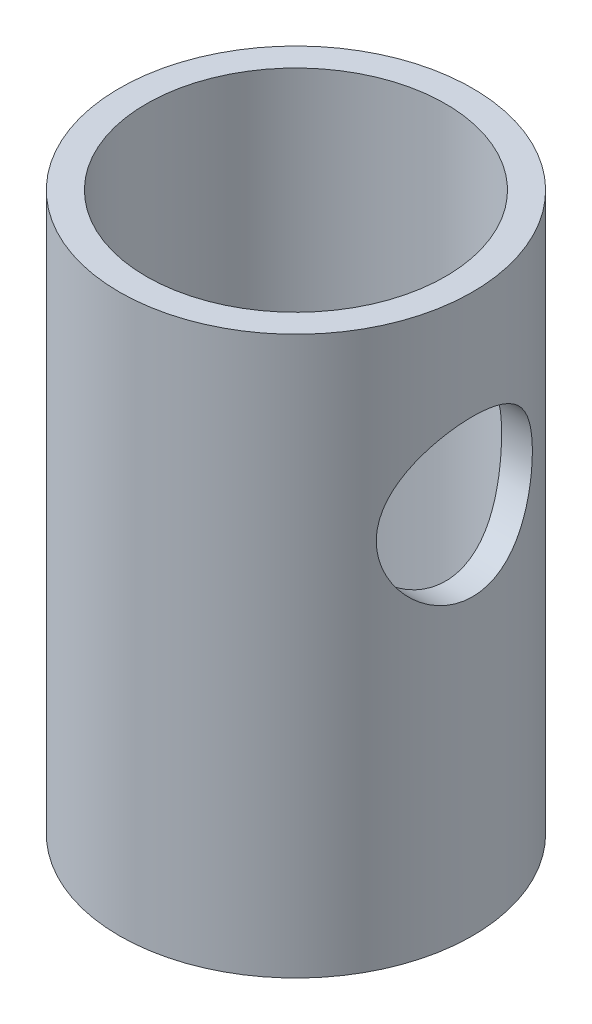
ISO-10303-21;
HEADER;
FILE_DESCRIPTION(('STEP AP214'),'2;1');
FILE_NAME('part.step','',(''),(''),'','','');
FILE_SCHEMA(('AUTOMOTIVE_DESIGN { 1 0 10303 214 1 1 1 1 }'));
ENDSEC;
DATA;
#1=APPLICATION_CONTEXT('core data for automotive mechanical design processes');
#2=APPLICATION_PROTOCOL_DEFINITION('international standard','automotive_design',2000,#1);
#3=PRODUCT_CONTEXT('',#1,'mechanical');
#4=PRODUCT('Part','Part','',(#3));
#5=PRODUCT_RELATED_PRODUCT_CATEGORY('part','',(#4));
#6=PRODUCT_DEFINITION_FORMATION('','',#4);
#7=PRODUCT_DEFINITION_CONTEXT('part definition',#1,'design');
#8=PRODUCT_DEFINITION('design','',#6,#7);
#9=PRODUCT_DEFINITION_SHAPE('','',#8);
#10=(LENGTH_UNIT() NAMED_UNIT(*) SI_UNIT(.MILLI.,.METRE.));
#11=(NAMED_UNIT(*) PLANE_ANGLE_UNIT() SI_UNIT($,.RADIAN.));
#12=(NAMED_UNIT(*) SI_UNIT($,.STERADIAN.) SOLID_ANGLE_UNIT());
#13=UNCERTAINTY_MEASURE_WITH_UNIT(LENGTH_MEASURE(1.E-05),#10,'distance_accuracy_value','');
#14=(GEOMETRIC_REPRESENTATION_CONTEXT(3) GLOBAL_UNCERTAINTY_ASSIGNED_CONTEXT((#13)) GLOBAL_UNIT_ASSIGNED_CONTEXT((#10,
#11,#12)) REPRESENTATION_CONTEXT('',''));
#15=CARTESIAN_POINT('',(0.,0.,0.));
#16=DIRECTION('',(0.,0.,1.));
#17=DIRECTION('',(1.,0.,0.));
#18=AXIS2_PLACEMENT_3D('',#15,#16,#17);
#19=CARTESIAN_POINT('',(0.,76.2,0.));
#20=DIRECTION('',(0.,-1.,0.));
#21=DIRECTION('',(0.,0.,-1.));
#22=AXIS2_PLACEMENT_3D('',#19,#20,#21);
#23=CYLINDRICAL_SURFACE('',#22,24.13);
#24=CARTESIAN_POINT('',(0.,76.2,0.));
#25=DIRECTION('',(0.,1.,0.));
#26=DIRECTION('',(0.,0.,1.));
#27=AXIS2_PLACEMENT_3D('',#24,#25,#26);
#28=CIRCLE('',#27,24.13);
#29=CARTESIAN_POINT('',(0.,76.2,24.13));
#30=VERTEX_POINT('',#29);
#31=EDGE_CURVE('E10',#30,#30,#28,.T.);
#32=ORIENTED_EDGE('',*,*,#31,.F.);
#33=EDGE_LOOP('',(#32));
#34=FACE_BOUND('',#33,.T.);
#35=CARTESIAN_POINT('',(0.,0.,0.));
#36=DIRECTION('',(0.,1.,0.));
#37=DIRECTION('',(0.,0.,1.));
#38=AXIS2_PLACEMENT_3D('',#35,#36,#37);
#39=CIRCLE('',#38,24.13);
#40=CARTESIAN_POINT('',(0.,0.,24.13));
#41=VERTEX_POINT('',#40);
#42=EDGE_CURVE('E46',#41,#41,#39,.T.);
#43=ORIENTED_EDGE('',*,*,#42,.T.);
#44=EDGE_LOOP('',(#43));
#45=FACE_BOUND('',#44,.T.);
#46=CARTESIAN_POINT('',(21.643721399057,50.8,10.668));
#47=CARTESIAN_POINT('',(21.6437238929743,50.5172348359315,10.6679977628718));
#48=CARTESIAN_POINT('',(21.6492818983185,50.2343903368031,10.6567415273903));
#49=CARTESIAN_POINT('',(21.6713265091591,49.6707914267036,10.6118382845818));
#50=CARTESIAN_POINT('',(21.6878196727223,49.3900383722562,10.5781778408867));
#51=CARTESIAN_POINT('',(21.7312031013358,48.8322649284761,10.4887645413648));
#52=CARTESIAN_POINT('',(21.7581156524137,48.5552538662205,10.4329643243829));
#53=CARTESIAN_POINT('',(21.8214229271272,48.0075367107023,10.2998940707166));
#54=CARTESIAN_POINT('',(21.8578185129239,47.7368311931547,10.2226220818587));
#55=CARTESIAN_POINT('',(21.9387312594079,47.204710334102,10.0477954852205));
#56=CARTESIAN_POINT('',(21.9832107081135,46.9432583222672,9.95033477632834));
#57=CARTESIAN_POINT('',(22.0790677447889,46.429854145989,9.73578260472499));
#58=CARTESIAN_POINT('',(22.1304455519079,46.1779022836751,9.61869051832881));
#59=CARTESIAN_POINT('',(22.2386362533096,45.6849155655768,9.36583422612657));
#60=CARTESIAN_POINT('',(22.2954469179531,45.4438762906109,9.23007767027364));
#61=CARTESIAN_POINT('',(22.4130509750466,44.9736785447172,8.94071802371263));
#62=CARTESIAN_POINT('',(22.4738457181274,44.7445241505045,8.78710886705377));
#63=CARTESIAN_POINT('',(22.6018492117889,44.2850440626589,8.45265468550407));
#64=CARTESIAN_POINT('',(22.6692199437986,44.055571581713,8.27069858595581));
#65=CARTESIAN_POINT('',(22.8049606871159,43.612508232859,7.88871031250229));
#66=CARTESIAN_POINT('',(22.8733307469606,43.3989181394434,7.68867725814051));
#67=CARTESIAN_POINT('',(23.0093552489534,42.9886471372641,7.27149405813427));
#68=CARTESIAN_POINT('',(23.0770092584969,42.7919759899197,7.05433416778064));
#69=CARTESIAN_POINT('',(23.2098350907993,42.4168905588581,6.60420309627603));
#70=CARTESIAN_POINT('',(23.2750077595255,42.2384700173019,6.37123738056867));
#71=CARTESIAN_POINT('',(23.40443490185,41.8924794701364,5.87855390769274));
#72=CARTESIAN_POINT('',(23.4684787991014,41.7259047335671,5.61808017074851));
#73=CARTESIAN_POINT('',(23.5902590762703,41.4154358778598,5.08251745632002));
#74=CARTESIAN_POINT('',(23.647995186105,41.271542729771,4.80742785377183));
#75=CARTESIAN_POINT('',(23.7554770064737,41.0078343025141,4.2445566901455));
#76=CARTESIAN_POINT('',(23.8052257946373,40.8880097448832,3.95678007229774));
#77=CARTESIAN_POINT('',(23.8952786432969,40.6736415299517,3.370530237231));
#78=CARTESIAN_POINT('',(23.9355834594923,40.5790958497695,3.07205787808203));
#79=CARTESIAN_POINT('',(24.0034953862544,40.4210838774224,2.48425626600895));
#80=CARTESIAN_POINT('',(24.03170101523,40.3561389562093,2.1953933053702));
#81=CARTESIAN_POINT('',(24.077838653201,40.2504072281897,1.61246605301352));
#82=CARTESIAN_POINT('',(24.0957710242367,40.2096195700546,1.31840194496597));
#83=CARTESIAN_POINT('',(24.1208408999613,40.152702557313,0.727553722890027));
#84=CARTESIAN_POINT('',(24.1279826171395,40.1365635802506,0.430770715818948));
#85=CARTESIAN_POINT('',(24.1312754119007,40.1291147405135,-0.163161882153493));
#86=CARTESIAN_POINT('',(24.1274269812917,40.1378037667882,-0.460311456056217));
#87=CARTESIAN_POINT('',(24.109492214626,40.1784542396317,-1.03221429151895));
#88=CARTESIAN_POINT('',(24.0961247938533,40.2087817520009,-1.30710814677459));
#89=CARTESIAN_POINT('',(24.0602929178545,40.2905580018281,-1.85311861349321));
#90=CARTESIAN_POINT('',(24.0378289602593,40.3420055839034,-2.12423543074198));
#91=CARTESIAN_POINT('',(23.9843568140684,40.4655048460105,-2.66087412748726));
#92=CARTESIAN_POINT('',(23.9533483378119,40.5375572197285,-2.92639581829363));
#93=CARTESIAN_POINT('',(23.8835326656958,40.7015862132358,-3.45015621685971));
#94=CARTESIAN_POINT('',(23.8447252223362,40.7935634653479,-3.70839469319013));
#95=CARTESIAN_POINT('',(23.7595826777815,40.998169863646,-4.21987652114506));
#96=CARTESIAN_POINT('',(23.7131432584816,41.1110884727117,-4.47298657194023));
#97=CARTESIAN_POINT('',(23.6142288564178,41.3557610470353,-4.96880609230699));
#98=CARTESIAN_POINT('',(23.5617517176067,41.4875217448382,-5.21151180379685));
#99=CARTESIAN_POINT('',(23.4519601662138,41.7689125962634,-5.68520765309818));
#100=CARTESIAN_POINT('',(23.394645289597,41.918544464658,-5.9161966636358));
#101=CARTESIAN_POINT('',(23.2764532178139,42.2347156712111,-6.36534086693001));
#102=CARTESIAN_POINT('',(23.2155757955955,42.4012560875019,-6.58349523991468));
#103=CARTESIAN_POINT('',(23.0867614042279,42.763906285462,-7.02243962903749));
#104=CARTESIAN_POINT('',(23.0186440303352,42.9613090412298,-7.2421097577275));
#105=CARTESIAN_POINT('',(22.8815637407171,43.3734897015066,-7.66421529494829));
#106=CARTESIAN_POINT('',(22.8126007883285,43.5882683616892,-7.86664995312633));
#107=CARTESIAN_POINT('',(22.6755978934853,44.0341239990691,-8.25325639570743));
#108=CARTESIAN_POINT('',(22.6075583469827,44.2652077199454,-8.4374205468674));
#109=CARTESIAN_POINT('',(22.4742627495828,44.7424180249921,-8.78631327080946));
#110=CARTESIAN_POINT('',(22.4090070581414,44.9885465418494,-8.95103933853463));
#111=CARTESIAN_POINT('',(22.2805517258455,45.5049661467721,-9.26628713230868));
#112=CARTESIAN_POINT('',(22.2175474445416,45.7758348830292,-9.41594446544033));
#113=CARTESIAN_POINT('',(22.0986844573346,46.3307091602367,-9.69162445431708));
#114=CARTESIAN_POINT('',(22.0428226028332,46.6147088369664,-9.81765753584738));
#115=CARTESIAN_POINT('',(21.9402158215194,47.1939520563278,-10.0448682589772));
#116=CARTESIAN_POINT('',(21.8934669822608,47.4891907084237,-10.1460565719238));
#117=CARTESIAN_POINT('',(21.8108485569363,48.0888085653558,-10.322465681998));
#118=CARTESIAN_POINT('',(21.7749778519041,48.3931868265148,-10.3976891500785));
#119=CARTESIAN_POINT('',(21.7176620213903,48.9869222197478,-10.5168488732797));
#120=CARTESIAN_POINT('',(21.6953805871389,49.2758326496267,-10.5626116812702));
#121=CARTESIAN_POINT('',(21.6623082351395,49.857088915808,-10.6302743892794));
#122=CARTESIAN_POINT('',(21.6515167681972,50.1494345872383,-10.6521754298376));
#123=CARTESIAN_POINT('',(21.6418395551652,50.7350252321199,-10.6718227472924));
#124=CARTESIAN_POINT('',(21.6429494387755,51.0282698359312,-10.6695778908134));
#125=CARTESIAN_POINT('',(21.6570222045817,51.6132868305406,-10.6409841785262));
#126=CARTESIAN_POINT('',(21.6699846302435,51.9050592776078,-10.6146362511157));
#127=CARTESIAN_POINT('',(21.7058382102837,52.4625720253878,-10.5411101968457));
#128=CARTESIAN_POINT('',(21.7278955848098,52.7285987970343,-10.4956763786638));
#129=CARTESIAN_POINT('',(21.7810067017056,53.2556769888029,-10.3850089989981));
#130=CARTESIAN_POINT('',(21.812063511071,53.5167266803633,-10.3197686871251));
#131=CARTESIAN_POINT('',(21.8822296458035,54.0321009750747,-10.1701396954301));
#132=CARTESIAN_POINT('',(21.9213374557648,54.2864268336734,-10.0857546188416));
#133=CARTESIAN_POINT('',(22.0065140774209,54.7870888273935,-9.89852569545463));
#134=CARTESIAN_POINT('',(22.0525856211738,55.0334217804081,-9.79567460095827));
#135=CARTESIAN_POINT('',(22.1526119948554,55.5274320873537,-9.56738641993507));
#136=CARTESIAN_POINT('',(22.2068250179896,55.7746889072217,-9.44115281916885));
#137=CARTESIAN_POINT('',(22.3200386627482,56.2578987519137,-9.17029555961702));
#138=CARTESIAN_POINT('',(22.3790413720952,56.4938467754338,-9.02566386574975));
#139=CARTESIAN_POINT('',(22.5003179959366,56.9532707339861,-8.71893257148724));
#140=CARTESIAN_POINT('',(22.5625924893431,57.1767444472782,-8.5568298743874));
#141=CARTESIAN_POINT('',(22.6888982668138,57.6101699625889,-8.21607042185577));
#142=CARTESIAN_POINT('',(22.7529296416136,57.8201210643382,-8.03741281029327));
#143=CARTESIAN_POINT('',(22.8873063988564,58.2446212560757,-7.64687219228914));
#144=CARTESIAN_POINT('',(22.9576789081601,58.4577437229755,-7.43344465787121));
#145=CARTESIAN_POINT('',(23.0968267854509,58.8653218394593,-6.98911077890607));
#146=CARTESIAN_POINT('',(23.1656026682547,59.059783571214,-6.75821017361705));
#147=CARTESIAN_POINT('',(23.2997922487106,59.4289766193138,-6.27999044034848));
#148=CARTESIAN_POINT('',(23.3652040234202,59.6036967180509,-6.03266210325822));
#149=CARTESIAN_POINT('',(23.490845721928,59.9319296645752,-5.52321096131169));
#150=CARTESIAN_POINT('',(23.5510778854282,60.0854516961331,-5.26109463291717));
#151=CARTESIAN_POINT('',(23.6652230157958,60.3712810025225,-4.72131660527399));
#152=CARTESIAN_POINT('',(23.7190794866081,60.5034019520966,-4.44354409374242));
#153=CARTESIAN_POINT('',(23.8183536632448,60.7436040914915,-3.87631465043014));
#154=CARTESIAN_POINT('',(23.8637712276046,60.851684878324,-3.58685752287473));
#155=CARTESIAN_POINT('',(23.9448040185114,61.0425794113759,-2.99856068518844));
#156=CARTESIAN_POINT('',(23.9804246934347,61.125407204419,-2.6997262935124));
#157=CARTESIAN_POINT('',(24.040808020632,61.2648810902704,-2.09493830661424));
#158=CARTESIAN_POINT('',(24.0655716184912,61.3215294631699,-1.78898533382223));
#159=CARTESIAN_POINT('',(24.1020110106598,61.4045994631909,-1.19633603222497));
#160=CARTESIAN_POINT('',(24.1145474674705,61.4330120439282,-0.909970111230644));
#161=CARTESIAN_POINT('',(24.1293755240433,61.466598318952,-0.335619865803533));
#162=CARTESIAN_POINT('',(24.1316676773395,61.471773268846,-0.0476356296556866));
#163=CARTESIAN_POINT('',(24.1259450833395,61.4588264732959,0.527646714649943));
#164=CARTESIAN_POINT('',(24.1179323122445,61.4407091946608,0.814944943780637));
#165=CARTESIAN_POINT('',(24.0918223206824,61.3813957378607,1.38668132630315));
#166=CARTESIAN_POINT('',(24.0737252121204,61.3401998157977,1.671119511397));
#167=CARTESIAN_POINT('',(24.0289374519508,61.2374896787456,2.22266979694318));
#168=CARTESIAN_POINT('',(24.0026566167092,61.1769413832718,2.4899960666298));
#169=CARTESIAN_POINT('',(23.9419570738193,61.0357556244966,3.01832655155642));
#170=CARTESIAN_POINT('',(23.9075386800225,60.9551189359634,3.27933101018985));
#171=CARTESIAN_POINT('',(23.831373717959,60.7744874419836,3.79342256073799));
#172=CARTESIAN_POINT('',(23.7896275761511,60.6744937630361,4.04651011238977));
#173=CARTESIAN_POINT('',(23.6997401496883,60.4559272001142,4.54345804926473));
#174=CARTESIAN_POINT('',(23.6515964157546,60.3373471973429,4.78731485438134));
#175=CARTESIAN_POINT('',(23.5476796804065,60.0767163783098,5.27529210352695));
#176=CARTESIAN_POINT('',(23.4916594057947,59.9338438674953,5.51892097190329));
#177=CARTESIAN_POINT('',(23.3751038917328,59.629752598283,5.99342448990041));
#178=CARTESIAN_POINT('',(23.3145669765783,59.468527018991,6.22429434998867));
#179=CARTESIAN_POINT('',(23.190386818345,59.1287675725899,6.6720955545669));
#180=CARTESIAN_POINT('',(23.1267430492722,58.9502307695884,6.88902452434588));
#181=CARTESIAN_POINT('',(22.9978230430922,58.5768811219934,7.30787664435476));
#182=CARTESIAN_POINT('',(22.932546731431,58.3820675331264,7.50979910759739));
#183=CARTESIAN_POINT('',(22.7967657755213,57.9613222464227,7.91284118258964));
#184=CARTESIAN_POINT('',(22.7262514613705,57.734148443613,8.11266317196043));
#185=CARTESIAN_POINT('',(22.5870730933772,57.263413954796,8.49246307849999));
#186=CARTESIAN_POINT('',(22.5184082805479,57.0198601387523,8.67244923249333));
#187=CARTESIAN_POINT('',(22.3848091441706,56.5173183859499,9.01168673646729));
#188=CARTESIAN_POINT('',(22.3198790659963,56.2583135409739,9.17091474058913));
#189=CARTESIAN_POINT('',(22.1958603036931,55.7266923644809,9.46712561695979));
#190=CARTESIAN_POINT('',(22.1367689507006,55.4540823384208,9.60411867131127));
#191=CARTESIAN_POINT('',(22.0261479134486,54.8958046731552,9.85518178883373));
#192=CARTESIAN_POINT('',(21.9746457355779,54.6100942296243,9.96916899514259));
#193=CARTESIAN_POINT('',(21.8813220681409,54.0285994012042,10.1723723563936));
#194=CARTESIAN_POINT('',(21.8394957370307,53.7328201398572,10.2616009044066));
#195=CARTESIAN_POINT('',(21.7671945151332,53.1341269236287,10.4140892954278));
#196=CARTESIAN_POINT('',(21.7366898343775,52.8312339546534,10.4774173343414));
#197=CARTESIAN_POINT('',(21.6881369467749,52.2202696467836,10.5775587767506));
#198=CARTESIAN_POINT('',(21.6700793535286,51.9122023898289,10.6143921608877));
#199=CARTESIAN_POINT('',(21.6536596198227,51.4694554397596,10.6478173860323));
#200=CARTESIAN_POINT('',(21.6499364193023,51.335712510108,10.6553828075778));
#201=CARTESIAN_POINT('',(21.6449666863159,51.06798566335,10.6654747090868));
#202=CARTESIAN_POINT('',(21.6437202171956,50.9340017401677,10.6680010601698));
#203=CARTESIAN_POINT('',(21.643721399057,50.8,10.668));
#204=B_SPLINE_CURVE_WITH_KNOTS('',3,(#46,#47,#48,#49,#50,#51,#52,#53,#54,#55,#56,#57,#58,#59,
#60,#61,#62,#63,#64,#65,#66,#67,#68,#69,#70,#71,#72,#73,#74,#75,#76,#77,#78,#79,#80,#81,#82,#83,
#84,#85,#86,#87,#88,#89,#90,#91,#92,#93,#94,#95,#96,#97,#98,#99,#100,#101,#102,#103,#104,#105,
#106,#107,#108,#109,#110,#111,#112,#113,#114,#115,#116,#117,#118,#119,#120,#121,#122,#123,#124,
#125,#126,#127,#128,#129,#130,#131,#132,#133,#134,#135,#136,#137,#138,#139,#140,#141,#142,#143,
#144,#145,#146,#147,#148,#149,#150,#151,#152,#153,#154,#155,#156,#157,#158,#159,#160,#161,#162,
#163,#164,#165,#166,#167,#168,#169,#170,#171,#172,#173,#174,#175,#176,#177,#178,#179,#180,#181,
#182,#183,#184,#185,#186,#187,#188,#189,#190,#191,#192,#193,#194,#195,#196,#197,#198,#199,#200,
#201,#202,#203),.UNSPECIFIED.,.T.,.F.,(4,2,2,2,2,2,2,2,2,2,2,2,2,2,2,2,2,2,2,2,2,2,2,2,2,2,2,2,
2,2,2,2,2,2,2,2,2,2,2,2,2,2,2,2,2,2,2,2,2,2,2,2,2,2,2,2,2,2,2,2,2,2,2,2,2,2,2,2,2,2,2,2,2,2,2,2,
2,2,4),(0.,0.848156658090868,1.69682243597562,2.5473135437935,3.39788200198872,4.24457983671681,
5.09130457596576,5.93768329944576,6.78435045063604,7.68488944313817,8.58547232097575,
9.48657135505696,10.3873603737098,11.3333985965687,12.279477310432,13.225190607181,
14.1708282028241,15.0618969602075,15.9529343134713,16.8436237308262,17.7342732905453,
18.5639496795708,19.393580686835,20.2232396279569,21.0529249024449,21.8950730485785,
22.7375228615442,23.5800535741876,24.4226380425257,25.3308962143502,26.2391939073403,
27.1478694943079,28.0566620580252,29.0028825253262,29.9486844211477,30.8940793618285,
31.8393770225766,32.7182739705781,33.5971289074145,34.4756611306072,35.3541595160817,
36.1655728012166,36.9772629408152,37.7888004388753,38.600657155081,39.4483466668265,
40.2964076730997,41.1446192446762,41.992874705678,42.9209562692759,43.8487343046004,
44.7770368994029,45.7049360494825,46.6405237445364,47.5761271217908,48.5112091218877,
49.4462096658576,50.3092428905189,51.1722294820252,52.0350506011139,52.8978621457336,
53.7229926826724,54.5480914009426,55.3731421162098,56.1985096120153,57.0613833685119,
57.9245788643967,58.7879210106019,59.6513026556869,60.5822016803633,61.5127126813104,
62.4442613248088,63.3753821710865,64.3097989018898,65.2437470584512,66.1752200529533,
67.1059898491453,67.5079189967809,67.9098584241265),.UNSPECIFIED.);
#205=CARTESIAN_POINT('',(21.643721399057,50.8,10.668));
#206=VERTEX_POINT('',#205);
#207=EDGE_CURVE('E56',#206,#206,#204,.T.);
#208=ORIENTED_EDGE('',*,*,#207,.F.);
#209=EDGE_LOOP('',(#208));
#210=FACE_BOUND('',#209,.T.);
#211=ADVANCED_FACE('F33',(#34,#45,#210),#23,.T.);
#212=CARTESIAN_POINT('',(0.,76.2,0.));
#213=DIRECTION('',(0.,-1.,0.));
#214=DIRECTION('',(0.,0.,-1.));
#215=AXIS2_PLACEMENT_3D('',#212,#213,#214);
#216=CYLINDRICAL_SURFACE('',#215,20.447);
#217=CARTESIAN_POINT('',(0.,0.,0.));
#218=DIRECTION('',(0.,1.,0.));
#219=DIRECTION('',(0.,0.,1.));
#220=AXIS2_PLACEMENT_3D('',#217,#218,#219);
#221=CIRCLE('',#220,20.447);
#222=CARTESIAN_POINT('',(0.,0.,20.447));
#223=VERTEX_POINT('',#222);
#224=EDGE_CURVE('E53',#223,#223,#221,.T.);
#225=ORIENTED_EDGE('',*,*,#224,.F.);
#226=EDGE_LOOP('',(#225));
#227=FACE_BOUND('',#226,.T.);
#228=CARTESIAN_POINT('',(0.,76.2,0.));
#229=DIRECTION('',(0.,1.,0.));
#230=DIRECTION('',(0.,0.,1.));
#231=AXIS2_PLACEMENT_3D('',#228,#229,#230);
#232=CIRCLE('',#231,20.447);
#233=CARTESIAN_POINT('',(0.,76.2,20.447));
#234=VERTEX_POINT('',#233);
#235=EDGE_CURVE('E51',#234,#234,#232,.T.);
#236=ORIENTED_EDGE('',*,*,#235,.T.);
#237=EDGE_LOOP('',(#236));
#238=FACE_BOUND('',#237,.T.);
#239=CARTESIAN_POINT('',(17.4434395977399,50.8,10.668));
#240=CARTESIAN_POINT('',(17.4434395734066,50.5238554869885,10.6680001097024));
#241=CARTESIAN_POINT('',(17.450018976375,50.2477101288396,10.6572642458151));
#242=CARTESIAN_POINT('',(17.4760799243084,49.6975861559307,10.6144740853894));
#243=CARTESIAN_POINT('',(17.4955667384452,49.4236084723189,10.5824110824845));
#244=CARTESIAN_POINT('',(17.5467297332575,48.879695877369,10.4973586971449));
#245=CARTESIAN_POINT('',(17.5784229907753,48.6097671827013,10.4443399948993));
#246=CARTESIAN_POINT('',(17.6528504460507,48.076142058988,10.3180444549338));
#247=CARTESIAN_POINT('',(17.695589482823,47.8124484168414,10.2447587375053));
#248=CARTESIAN_POINT('',(17.790353426008,47.2946472778841,10.079293328651));
#249=CARTESIAN_POINT('',(17.8423193518079,47.0404906345276,9.98723312353528));
#250=CARTESIAN_POINT('',(17.9541363632364,46.5412862598898,9.78479242381233));
#251=CARTESIAN_POINT('',(18.0139903239517,46.2962418918723,9.67440524543088));
#252=CARTESIAN_POINT('',(18.1398844057333,45.8164867424128,9.43623519474605));
#253=CARTESIAN_POINT('',(18.2059234600268,45.5817741892207,9.30845532052771));
#254=CARTESIAN_POINT('',(18.3425148781242,45.1235479836982,9.03632298406641));
#255=CARTESIAN_POINT('',(18.4130673940205,44.9000347092085,8.89196996321949));
#256=CARTESIAN_POINT('',(18.5635373442333,44.4453619636487,8.57371547136618));
#257=CARTESIAN_POINT('',(18.6437251403196,44.21533457675,8.3983228440709));
#258=CARTESIAN_POINT('',(18.8054268623633,43.7705313810215,8.02970960905876));
#259=CARTESIAN_POINT('',(18.8869408550562,43.5557563426392,7.83648810187697));
#260=CARTESIAN_POINT('',(19.0493523249319,43.1422974714077,7.43298785191032));
#261=CARTESIAN_POINT('',(19.1302493310863,42.9436249970014,7.22269727463618));
#262=CARTESIAN_POINT('',(19.2894126145526,42.5636411140536,6.786186049484));
#263=CARTESIAN_POINT('',(19.3676798082293,42.3823236165464,6.55997103736829));
#264=CARTESIAN_POINT('',(19.5255026374313,42.0250780496106,6.074898781841));
#265=CARTESIAN_POINT('',(19.6047105267478,41.850586954101,5.81486637339179));
#266=CARTESIAN_POINT('',(19.7557837237414,41.5243158543002,5.27885835531359));
#267=CARTESIAN_POINT('',(19.8276485633029,41.3725372976355,5.0028817310025));
#268=CARTESIAN_POINT('',(19.9619312149257,41.0932964305347,4.4368522250483));
#269=CARTESIAN_POINT('',(20.0243539878199,40.9658213418974,4.14680684162537));
#270=CARTESIAN_POINT('',(20.137913618815,40.7366059592988,3.55458892170803));
#271=CARTESIAN_POINT('',(20.189051801523,40.6348626446867,3.25241781348122));
#272=CARTESIAN_POINT('',(20.2750214364809,40.4652125231194,2.66185057078234));
#273=CARTESIAN_POINT('',(20.3107995765622,40.3953158888692,2.37416329394904));
#274=CARTESIAN_POINT('',(20.3703501328036,40.2795412997887,1.79276535036982));
#275=CARTESIAN_POINT('',(20.3941231087835,40.2336622249783,1.49905496515566));
#276=CARTESIAN_POINT('',(20.428960294743,40.1665783773681,0.908245913742118));
#277=CARTESIAN_POINT('',(20.4400316390127,40.1453597531262,0.61114924436854));
#278=CARTESIAN_POINT('',(20.449158635127,40.1278603381755,0.0160307364101794));
#279=CARTESIAN_POINT('',(20.4472151788149,40.1315778387108,-0.281991037382683));
#280=CARTESIAN_POINT('',(20.4311749416729,40.1623562665995,-0.848159234628867));
#281=CARTESIAN_POINT('',(20.4182455089184,40.1871751546932,-1.1164642895533));
#282=CARTESIAN_POINT('',(20.3820904497644,40.2569019313557,-1.64972833937283));
#283=CARTESIAN_POINT('',(20.3588656149519,40.3018082754541,-1.91468758990769));
#284=CARTESIAN_POINT('',(20.3026702115553,40.4112064045967,-2.43947596375631));
#285=CARTESIAN_POINT('',(20.2696993183545,40.4756988420065,-2.6993049158851));
#286=CARTESIAN_POINT('',(20.1947721961269,40.6235910496626,-3.2121907540065));
#287=CARTESIAN_POINT('',(20.1528156320596,40.7069915249224,-3.46524738708994));
#288=CARTESIAN_POINT('',(20.060269042513,40.8930624698413,-3.96624414816446));
#289=CARTESIAN_POINT('',(20.0095779407781,40.9959601344301,-4.21408121123583));
#290=CARTESIAN_POINT('',(19.90103718689,41.2194361852425,-4.70006688054504));
#291=CARTESIAN_POINT('',(19.843185006717,41.3400208181534,-4.93821202567145));
#292=CARTESIAN_POINT('',(19.6606968781631,41.7268863078531,-5.63627827009367));
#293=CARTESIAN_POINT('',(19.5270706956141,42.0183931978701,-6.08013538144202));
#294=CARTESIAN_POINT('',(19.2323578730295,42.6937471522114,-6.95934058131843));
#295=CARTESIAN_POINT('',(19.069861123393,43.0839296347405,-7.38935182584528));
#296=CARTESIAN_POINT('',(18.8256201361817,43.717044850915,-7.98259838288103));
#297=CARTESIAN_POINT('',(18.7440593643885,43.9362484791943,-8.17184751597675));
#298=CARTESIAN_POINT('',(18.5827607251706,44.3898237675041,-8.53227586671956));
#299=CARTESIAN_POINT('',(18.5030231509276,44.624197844146,-8.70345219393383));
#300=CARTESIAN_POINT('',(18.3417589348941,45.1248987802647,-9.03862911274743));
#301=CARTESIAN_POINT('',(18.2605359720766,45.3923068690287,-9.20116319914569));
#302=CARTESIAN_POINT('',(18.1053922837633,45.9419053901275,-9.50280691677476));
#303=CARTESIAN_POINT('',(18.0314682752774,46.2240890883448,-9.64192709934584));
#304=CARTESIAN_POINT('',(17.893647821965,46.8015522394956,-9.89535186719065));
#305=CARTESIAN_POINT('',(17.8297450334972,47.0968232547876,-10.0096721690207));
#306=CARTESIAN_POINT('',(17.7145480281079,47.6985879068871,-10.2121592701562));
#307=CARTESIAN_POINT('',(17.6632519418283,48.0050798720666,-10.3003299474045));
#308=CARTESIAN_POINT('',(17.5791437119681,48.60165183593,-10.4431710306029));
#309=CARTESIAN_POINT('',(17.5451733769083,48.8910583009802,-10.4999718356159));
#310=CARTESIAN_POINT('',(17.491286561641,49.4748753709158,-10.5894973608498));
#311=CARTESIAN_POINT('',(17.4713692420186,49.7692856758358,-10.6222235191029));
#312=CARTESIAN_POINT('',(17.4464869784834,50.3602235602867,-10.6630425811164));
#313=CARTESIAN_POINT('',(17.4415109631282,50.6567494088054,-10.671153724545));
#314=CARTESIAN_POINT('',(17.4467106262445,51.2492989573902,-10.6626511494234));
#315=CARTESIAN_POINT('',(17.4568850460035,51.5453226971262,-10.6460394848674));
#316=CARTESIAN_POINT('',(17.4897256459558,52.0973661906036,-10.591984580889));
#317=CARTESIAN_POINT('',(17.5106774555953,52.3537747650355,-10.5573947509341));
#318=CARTESIAN_POINT('',(17.5631208736038,52.8624372333239,-10.4699186007528));
#319=CARTESIAN_POINT('',(17.5946159258366,53.1146897413507,-10.4170263019848));
#320=CARTESIAN_POINT('',(17.6671416173261,53.6133903119328,-10.2935432452108));
#321=CARTESIAN_POINT('',(17.7081713203203,53.8598389417891,-10.2229542248949));
#322=CARTESIAN_POINT('',(17.7985519003978,54.3456931289585,-10.0647721662117));
#323=CARTESIAN_POINT('',(17.8479060923395,54.5850958357658,-9.97717235193958));
#324=CARTESIAN_POINT('',(18.011199919399,55.312078399828,-9.68136417787735));
#325=CARTESIAN_POINT('',(18.1369598017333,55.7861179321284,-9.44567197476053));
#326=CARTESIAN_POINT('',(18.4061409451815,56.6906404508641,-8.90973658785186));
#327=CARTESIAN_POINT('',(18.5495712631741,57.1211008934588,-8.60946024253859));
#328=CARTESIAN_POINT('',(18.7786783409107,57.7578468625723,-8.09218050419811));
#329=CARTESIAN_POINT('',(18.8626920798127,57.9809871307466,-7.89482890680097));
#330=CARTESIAN_POINT('',(19.0301815637667,58.4100754734361,-7.48208115549586));
#331=CARTESIAN_POINT('',(19.1136574539319,58.6160283811901,-7.26669010881016));
#332=CARTESIAN_POINT('',(19.2780303206827,59.0098054569114,-6.8186762645169));
#333=CARTESIAN_POINT('',(19.3589250863815,59.197614348593,-6.58603923296433));
#334=CARTESIAN_POINT('',(19.5160012279568,59.5536408809618,-6.10487641859161));
#335=CARTESIAN_POINT('',(19.5921845733498,59.7218667342581,-5.85635736449659));
#336=CARTESIAN_POINT('',(19.7405761081018,60.043257791738,-5.3353031389841));
#337=CARTESIAN_POINT('',(19.8125401619382,60.1956561992012,-5.0622239993564));
#338=CARTESIAN_POINT('',(19.9473277322959,60.4766471479902,-4.50188291304914));
#339=CARTESIAN_POINT('',(20.0101508674969,60.6052386962558,-4.21462037536769));
#340=CARTESIAN_POINT('',(20.1247500129701,60.8370376017037,-3.62814491428606));
#341=CARTESIAN_POINT('',(20.1765345409122,60.9402645403253,-3.32894141804523));
#342=CARTESIAN_POINT('',(20.2675027412193,61.1200827606052,-2.72077628899872));
#343=CARTESIAN_POINT('',(20.3066880700017,61.1966775437021,-2.41181594479656));
#344=CARTESIAN_POINT('',(20.3680764078566,61.3160495700348,-1.81709453528195));
#345=CARTESIAN_POINT('',(20.3915541302315,61.361378599269,-1.53197504209796));
#346=CARTESIAN_POINT('',(20.4265532083543,61.4287971126818,-0.958275808573374));
#347=CARTESIAN_POINT('',(20.4380753555212,61.4508881351398,-0.669696298553689));
#348=CARTESIAN_POINT('',(20.4488382886818,61.4715265345303,-0.0915715006531224));
#349=CARTESIAN_POINT('',(20.4480834080312,61.4700822186027,0.19797341039899));
#350=CARTESIAN_POINT('',(20.4343237415383,61.4436897221634,0.775690626975773));
#351=CARTESIAN_POINT('',(20.4213193988664,61.4187423919615,1.06386298177874));
#352=CARTESIAN_POINT('',(20.3848663738573,61.3484601867993,1.61473849178573));
#353=CARTESIAN_POINT('',(20.3622837658042,61.304813393568,1.87771695430266));
#354=CARTESIAN_POINT('',(20.3075029316069,61.1982296866349,2.39869345488875));
#355=CARTESIAN_POINT('',(20.2753053240915,61.1352940139722,2.65669181224117));
#356=CARTESIAN_POINT('',(20.2020221139103,60.9907795637539,3.16612533167886));
#357=CARTESIAN_POINT('',(20.1609359083208,60.9091995215086,3.41756004724777));
#358=CARTESIAN_POINT('',(20.0707735840404,60.7281682865997,3.91243226676111));
#359=CARTESIAN_POINT('',(20.0216970866002,60.6287162467594,4.15586939095261));
#360=CARTESIAN_POINT('',(19.9145046630881,60.4085130866918,4.64294412391087));
#361=CARTESIAN_POINT('',(19.8561081212635,60.287075484499,4.88620934980298));
#362=CARTESIAN_POINT('',(19.7330409764096,60.0267265417384,5.36164455916212));
#363=CARTESIAN_POINT('',(19.6683680785125,59.8878088042388,5.59381043763368));
#364=CARTESIAN_POINT('',(19.53412198015,59.5934911129965,6.04594940826652));
#365=CARTESIAN_POINT('',(19.4645487137131,59.4380909373438,6.26592233620827));
#366=CARTESIAN_POINT('',(19.3219041023451,59.111675493313,6.69287058448868));
#367=CARTESIAN_POINT('',(19.2488315089973,58.9406546320709,6.89984120433336));
#368=CARTESIAN_POINT('',(19.092785778188,58.5648656925158,7.32127463683601));
#369=CARTESIAN_POINT('',(19.0095879378086,58.3584437250227,7.53418206430968));
#370=CARTESIAN_POINT('',(18.8428326908443,57.9286733319893,7.94204126555468));
#371=CARTESIAN_POINT('',(18.7592752528556,57.7053233986218,8.13699143638221));
#372=CARTESIAN_POINT('',(18.5938795678043,57.2424792335161,8.50815983985157));
#373=CARTESIAN_POINT('',(18.5120435172429,57.002965843375,8.68435518195721));
#374=CARTESIAN_POINT('',(18.3524954129508,56.5092082046121,9.01663364534066));
#375=CARTESIAN_POINT('',(18.2747817611307,56.2549697454573,9.17272459429994));
#376=CARTESIAN_POINT('',(18.1223434877428,55.7207961124172,9.47046631586677));
#377=CARTESIAN_POINT('',(18.0479216129886,55.4402166758228,9.61112025328207));
#378=CARTESIAN_POINT('',(17.908807445706,54.8656448316477,9.86791646340265));
#379=CARTESIAN_POINT('',(17.8441167927056,54.571650174705,9.98405460698351));
#380=CARTESIAN_POINT('',(17.7272806699134,53.9731304808687,10.1900604553972));
#381=CARTESIAN_POINT('',(17.6750994564205,53.6686383608086,10.280003171584));
#382=CARTESIAN_POINT('',(17.5854247277659,53.0509539873274,10.4326661470425));
#383=CARTESIAN_POINT('',(17.547921286891,52.7377677672303,10.4954048059251));
#384=CARTESIAN_POINT('',(17.4939001615116,52.1542277818518,10.5851566786395));
#385=CARTESIAN_POINT('',(17.4750408159149,51.8847012886236,10.6161824600951));
#386=CARTESIAN_POINT('',(17.4498101836455,51.3434502207927,10.6576046653864));
#387=CARTESIAN_POINT('',(17.4434396216838,51.071725519549,10.6679998920531));
#388=CARTESIAN_POINT('',(17.4434395977399,50.8,10.668));
#389=B_SPLINE_CURVE_WITH_KNOTS('',3,(#239,#240,#241,#242,#243,#244,#245,#246,#247,#248,#249,
#250,#251,#252,#253,#254,#255,#256,#257,#258,#259,#260,#261,#262,#263,#264,#265,#266,#267,#268,
#269,#270,#271,#272,#273,#274,#275,#276,#277,#278,#279,#280,#281,#282,#283,#284,#285,#286,#287,
#288,#289,#290,#291,#292,#293,#294,#295,#296,#297,#298,#299,#300,#301,#302,#303,#304,#305,#306,
#307,#308,#309,#310,#311,#312,#313,#314,#315,#316,#317,#318,#319,#320,#321,#322,#323,#324,#325,
#326,#327,#328,#329,#330,#331,#332,#333,#334,#335,#336,#337,#338,#339,#340,#341,#342,#343,#344,
#345,#346,#347,#348,#349,#350,#351,#352,#353,#354,#355,#356,#357,#358,#359,#360,#361,#362,#363,
#364,#365,#366,#367,#368,#369,#370,#371,#372,#373,#374,#375,#376,#377,#378,#379,#380,#381,#382,
#383,#384,#385,#386,#387,#388),.UNSPECIFIED.,.T.,.F.,(4,2,2,2,2,2,2,2,2,2,2,2,2,2,2,2,2,2,2,2,2,
2,2,2,2,2,2,2,2,2,2,2,2,2,2,2,2,2,2,2,2,2,2,2,2,2,2,2,2,2,2,2,2,2,2,2,2,2,2,2,2,2,2,2,2,2,2,2,2,
2,2,2,2,2,4),(0.,0.828151381760076,1.65664104696517,2.48629400618168,3.31631104368375,
4.14120182086884,4.96639409594053,5.79144430730199,6.61652233545065,7.51610461618045,
8.41573230557221,9.31598915035783,10.2159289747397,11.1837185444963,12.1515697718962,
13.11891071361,14.0861380464892,14.9795437557619,15.8729078002778,16.7657698113863,
17.6585706394676,18.4668945923592,19.2751564060795,20.083445144013,20.891764025119,
21.7101563864647,22.528838486897,24.1652198542135,25.9660344298013,26.8678641194151,
27.7698378233067,28.738505938422,29.7067363531708,30.6743513620238,31.6418228034554,
32.5311621570528,33.4204483841179,34.3090754910828,35.1976287741913,35.9754720014747,
36.7535695531846,37.5315907312487,38.3099224563498,39.9355512362739,41.5620167164694,
42.4896780998999,43.4170777314205,44.3452515002763,45.2730346044584,46.2344426604877,
47.1958908108796,48.1565943762158,49.1171715861149,49.9849691348066,50.8527092345502,
51.7201430594489,52.5875455028743,53.3892215425036,54.1908460134193,54.992524876479,
55.7942417511273,56.6276466247647,57.4613573784188,58.2950793580958,59.1291010243658,
60.0520778739961,60.9751370329234,61.8993101835952,62.8231224110008,63.7895037004017,
64.7560476249754,65.7197959803486,66.6828914786933,67.4977431116954,68.3126420282805),.UNSPECIFIED.);
#390=CARTESIAN_POINT('',(17.4434395977399,50.8,10.668));
#391=VERTEX_POINT('',#390);
#392=EDGE_CURVE('E37',#391,#391,#389,.T.);
#393=ORIENTED_EDGE('',*,*,#392,.T.);
#394=EDGE_LOOP('',(#393));
#395=FACE_BOUND('',#394,.T.);
#396=ADVANCED_FACE('F68',(#227,#238,#395),#216,.F.);
#397=CARTESIAN_POINT('',(0.,76.2,0.));
#398=DIRECTION('',(0.,1.,0.));
#399=DIRECTION('',(0.,0.,1.));
#400=AXIS2_PLACEMENT_3D('',#397,#398,#399);
#401=PLANE('',#400);
#402=ORIENTED_EDGE('',*,*,#31,.T.);
#403=EDGE_LOOP('',(#402));
#404=FACE_BOUND('',#403,.T.);
#405=ORIENTED_EDGE('',*,*,#235,.F.);
#406=EDGE_LOOP('',(#405));
#407=FACE_BOUND('',#406,.T.);
#408=ADVANCED_FACE('F73',(#404,#407),#401,.T.);
#409=CARTESIAN_POINT('',(0.,0.,0.));
#410=DIRECTION('',(0.,1.,0.));
#411=DIRECTION('',(0.,0.,1.));
#412=AXIS2_PLACEMENT_3D('',#409,#410,#411);
#413=PLANE('',#412);
#414=ORIENTED_EDGE('',*,*,#42,.F.);
#415=EDGE_LOOP('',(#414));
#416=FACE_BOUND('',#415,.T.);
#417=ORIENTED_EDGE('',*,*,#224,.T.);
#418=EDGE_LOOP('',(#417));
#419=FACE_BOUND('',#418,.T.);
#420=ADVANCED_FACE('F66',(#416,#419),#413,.F.);
#421=CARTESIAN_POINT('',(76.2,50.8,0.));
#422=DIRECTION('',(-1.,0.,0.));
#423=DIRECTION('',(0.,0.,1.));
#424=AXIS2_PLACEMENT_3D('',#421,#422,#423);
#425=CYLINDRICAL_SURFACE('',#424,10.668);
#426=ORIENTED_EDGE('',*,*,#392,.F.);
#427=EDGE_LOOP('',(#426));
#428=FACE_BOUND('',#427,.T.);
#429=ORIENTED_EDGE('',*,*,#207,.T.);
#430=EDGE_LOOP('',(#429));
#431=FACE_BOUND('',#430,.T.);
#432=ADVANCED_FACE('F63',(#428,#431),#425,.F.);
#433=CLOSED_SHELL('',(#211,#396,#408,#420,#432));
#434=MANIFOLD_SOLID_BREP('B2',#433);
#435=ADVANCED_BREP_SHAPE_REPRESENTATION('',(#18,#434),#14);
#436=SHAPE_DEFINITION_REPRESENTATION(#9,#435);
ENDSEC;
END-ISO-10303-21;
